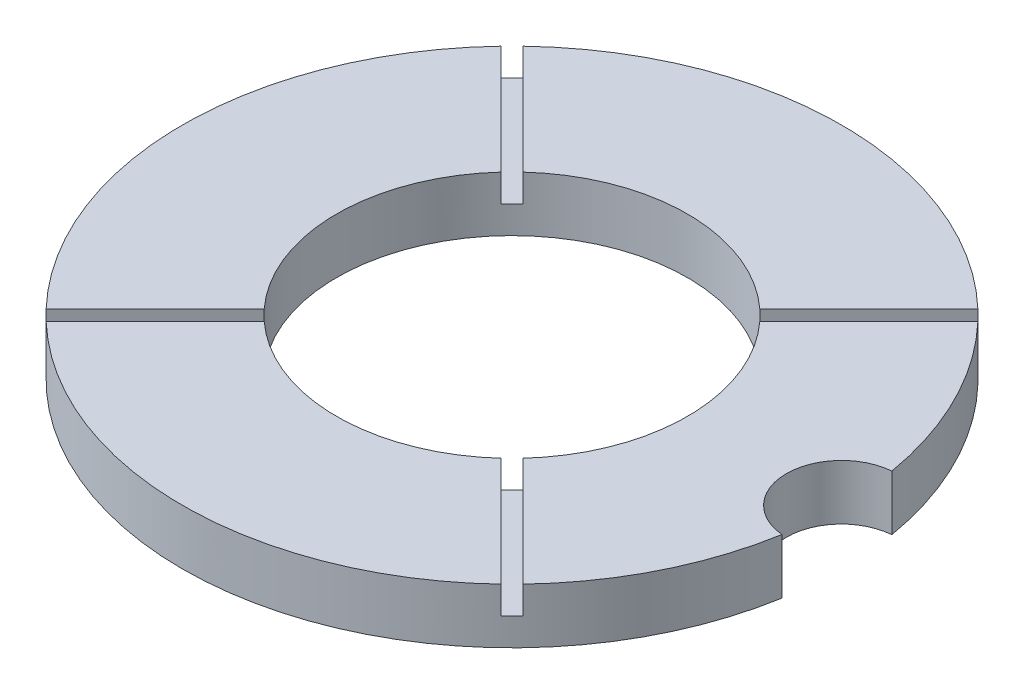
ISO-10303-21;
HEADER;
FILE_DESCRIPTION(('STEP AP214'),'2;1');
FILE_NAME('part.step','',(''),(''),'','','');
FILE_SCHEMA(('AUTOMOTIVE_DESIGN { 1 0 10303 214 1 1 1 1 }'));
ENDSEC;
DATA;
#1=APPLICATION_CONTEXT('core data for automotive mechanical design processes');
#2=APPLICATION_PROTOCOL_DEFINITION('international standard','automotive_design',2000,#1);
#3=PRODUCT_CONTEXT('',#1,'mechanical');
#4=PRODUCT('Part','Part','',(#3));
#5=PRODUCT_RELATED_PRODUCT_CATEGORY('part','',(#4));
#6=PRODUCT_DEFINITION_FORMATION('','',#4);
#7=PRODUCT_DEFINITION_CONTEXT('part definition',#1,'design');
#8=PRODUCT_DEFINITION('design','',#6,#7);
#9=PRODUCT_DEFINITION_SHAPE('','',#8);
#10=(LENGTH_UNIT() NAMED_UNIT(*) SI_UNIT(.MILLI.,.METRE.));
#11=(NAMED_UNIT(*) PLANE_ANGLE_UNIT() SI_UNIT($,.RADIAN.));
#12=(NAMED_UNIT(*) SI_UNIT($,.STERADIAN.) SOLID_ANGLE_UNIT());
#13=UNCERTAINTY_MEASURE_WITH_UNIT(LENGTH_MEASURE(1.E-05),#10,'distance_accuracy_value','');
#14=(GEOMETRIC_REPRESENTATION_CONTEXT(3) GLOBAL_UNCERTAINTY_ASSIGNED_CONTEXT((#13)) GLOBAL_UNIT_ASSIGNED_CONTEXT((#10,
#11,#12)) REPRESENTATION_CONTEXT('',''));
#15=CARTESIAN_POINT('',(0.,0.,0.));
#16=DIRECTION('',(0.,0.,1.));
#17=DIRECTION('',(1.,0.,0.));
#18=AXIS2_PLACEMENT_3D('',#15,#16,#17);
#19=CARTESIAN_POINT('',(0.,12.7,0.));
#20=DIRECTION('',(0.,1.,0.));
#21=DIRECTION('',(0.,0.,1.));
#22=AXIS2_PLACEMENT_3D('',#19,#20,#21);
#23=PLANE('',#22);
#24=DIRECTION('',(0.707106781186546,0.,-0.707106781186555));
#25=VECTOR('',#24,1.);
#26=CARTESIAN_POINT('',(-25.7014930184937,12.7,28.1800437079155));
#27=LINE('',#26,#25);
#28=CARTESIAN_POINT('',(-52.4303897259787,12.7,54.9089404154006));
#29=VERTEX_POINT('',#28);
#30=CARTESIAN_POINT('',(-27.3090139490453,12.7,29.787564638468));
#31=VERTEX_POINT('',#30);
#32=EDGE_CURVE('E272',#29,#31,#27,.T.);
#33=ORIENTED_EDGE('',*,*,#32,.F.);
#34=CARTESIAN_POINT('',(0.,12.7,0.));
#35=DIRECTION('',(0.,1.,0.));
#36=DIRECTION('',(0.,0.,1.));
#37=AXIS2_PLACEMENT_3D('',#34,#35,#36);
#38=CIRCLE('',#37,75.9206);
#39=CARTESIAN_POINT('',(52.4303897259896,12.7,54.908940415392));
#40=VERTEX_POINT('',#39);
#41=EDGE_CURVE('E210',#29,#40,#38,.T.);
#42=ORIENTED_EDGE('',*,*,#41,.T.);
#43=DIRECTION('',(0.707106781186555,0.,0.707106781186546));
#44=VECTOR('',#43,1.);
#45=CARTESIAN_POINT('',(25.7014930185073,12.7,28.1800437079099));
#46=LINE('',#45,#44);
#47=CARTESIAN_POINT('',(27.3090139490553,12.7,29.7875646384579));
#48=VERTEX_POINT('',#47);
#49=EDGE_CURVE('E357',#48,#40,#46,.T.);
#50=ORIENTED_EDGE('',*,*,#49,.F.);
#51=CARTESIAN_POINT('',(0.,12.7,0.));
#52=DIRECTION('',(0.,1.,0.));
#53=DIRECTION('',(0.,0.,1.));
#54=AXIS2_PLACEMENT_3D('',#51,#52,#53);
#55=CIRCLE('',#54,40.4114);
#56=EDGE_CURVE('E280',#31,#48,#55,.T.);
#57=ORIENTED_EDGE('',*,*,#56,.F.);
#58=EDGE_LOOP('',(#33,#42,#50,#57));
#59=FACE_BOUND('',#58,.T.);
#60=ADVANCED_FACE('F53',(#59),#23,.T.);
#61=DIRECTION('',(-0.707106781186555,0.,-0.707106781186546));
#62=VECTOR('',#61,1.);
#63=CARTESIAN_POINT('',(28.1800437079215,12.7,25.7014930184939));
#64=LINE('',#63,#62);
#65=CARTESIAN_POINT('',(54.9089404154035,12.7,52.4303897259765));
#66=VERTEX_POINT('',#65);
#67=CARTESIAN_POINT('',(29.7875646384708,12.7,27.3090139490432));
#68=VERTEX_POINT('',#67);
#69=EDGE_CURVE('E361',#66,#68,#64,.T.);
#70=ORIENTED_EDGE('',*,*,#69,.F.);
#71=CARTESIAN_POINT('',(74.8583718300435,12.7,12.6554996469904));
#72=VERTEX_POINT('',#71);
#73=EDGE_CURVE('E218',#66,#72,#38,.T.);
#74=ORIENTED_EDGE('',*,*,#73,.T.);
#75=CARTESIAN_POINT('',(75.9206,12.7,9.99200722162641E-13));
#76=DIRECTION('',(0.,1.,0.));
#77=DIRECTION('',(0.,0.,1.));
#78=AXIS2_PLACEMENT_3D('',#75,#76,#77);
#79=CIRCLE('',#78,12.7);
#80=CARTESIAN_POINT('',(74.8583718300444,12.7,-12.6554996469894));
#81=VERTEX_POINT('',#80);
#82=EDGE_CURVE('E295',#81,#72,#79,.T.);
#83=ORIENTED_EDGE('',*,*,#82,.F.);
#84=CARTESIAN_POINT('',(54.908940415395,12.7,-52.4303897259856));
#85=VERTEX_POINT('',#84);
#86=EDGE_CURVE('E216',#81,#85,#38,.T.);
#87=ORIENTED_EDGE('',*,*,#86,.T.);
#88=DIRECTION('',(0.707106781186546,0.,-0.707106781186555));
#89=VECTOR('',#88,1.);
#90=CARTESIAN_POINT('',(28.180043707915,12.7,-25.7014930185052));
#91=LINE('',#90,#89);
#92=CARTESIAN_POINT('',(29.7875646384609,12.7,-27.3090139490519));
#93=VERTEX_POINT('',#92);
#94=EDGE_CURVE('E370',#93,#85,#91,.T.);
#95=ORIENTED_EDGE('',*,*,#94,.F.);
#96=EDGE_CURVE('E230',#68,#93,#55,.T.);
#97=ORIENTED_EDGE('',*,*,#96,.F.);
#98=EDGE_LOOP('',(#70,#74,#83,#87,#95,#97));
#99=FACE_BOUND('',#98,.T.);
#100=ADVANCED_FACE('F390',(#99),#23,.T.);
#101=DIRECTION('',(-0.707106781186546,0.,0.707106781186555));
#102=VECTOR('',#101,1.);
#103=CARTESIAN_POINT('',(25.7014930185,12.7,-28.1800437079203));
#104=LINE('',#103,#102);
#105=CARTESIAN_POINT('',(52.4303897259789,12.7,-54.9089404153994));
#106=VERTEX_POINT('',#105);
#107=CARTESIAN_POINT('',(27.3090139490465,12.7,-29.7875646384658));
#108=VERTEX_POINT('',#107);
#109=EDGE_CURVE('E202',#106,#108,#104,.T.);
#110=ORIENTED_EDGE('',*,*,#109,.F.);
#111=CARTESIAN_POINT('',(-52.4303897259825,12.7,-54.9089404153958));
#112=VERTEX_POINT('',#111);
#113=EDGE_CURVE('E209',#106,#112,#38,.T.);
#114=ORIENTED_EDGE('',*,*,#113,.T.);
#115=DIRECTION('',(-0.707106781186555,0.,-0.707106781186547));
#116=VECTOR('',#115,1.);
#117=CARTESIAN_POINT('',(-25.7014930184991,12.7,-28.1800437079148));
#118=LINE('',#117,#116);
#119=CARTESIAN_POINT('',(-27.3090139490489,12.7,-29.7875646384628));
#120=VERTEX_POINT('',#119);
#121=EDGE_CURVE('E201',#120,#112,#118,.T.);
#122=ORIENTED_EDGE('',*,*,#121,.F.);
#123=EDGE_CURVE('E279',#108,#120,#55,.T.);
#124=ORIENTED_EDGE('',*,*,#123,.F.);
#125=EDGE_LOOP('',(#110,#114,#122,#124));
#126=FACE_BOUND('',#125,.T.);
#127=ADVANCED_FACE('F405',(#126),#23,.T.);
#128=CARTESIAN_POINT('',(0.,12.7,0.));
#129=DIRECTION('',(0.,-1.,0.));
#130=DIRECTION('',(0.,0.,-1.));
#131=AXIS2_PLACEMENT_3D('',#128,#129,#130);
#132=CYLINDRICAL_SURFACE('',#131,75.9206);
#133=ORIENTED_EDGE('',*,*,#41,.F.);
#134=DIRECTION('',(0.,-1.,0.));
#135=VECTOR('',#134,1.);
#136=CARTESIAN_POINT('',(-52.4303897259787,12.7,54.9089404154006));
#137=LINE('',#136,#135);
#138=CARTESIAN_POINT('',(-52.4303897259787,6.34999999999999,54.9089404154006));
#139=VERTEX_POINT('',#138);
#140=EDGE_CURVE('E299',#29,#139,#137,.T.);
#141=ORIENTED_EDGE('',*,*,#140,.T.);
#142=CARTESIAN_POINT('',(0.,6.34999999999999,0.));
#143=DIRECTION('',(0.,-1.,0.));
#144=DIRECTION('',(0.,0.,-1.));
#145=AXIS2_PLACEMENT_3D('',#142,#143,#144);
#146=CIRCLE('',#145,75.9206);
#147=CARTESIAN_POINT('',(-54.9089404153937,6.34999999999999,52.4303897259858));
#148=VERTEX_POINT('',#147);
#149=EDGE_CURVE('E308',#139,#148,#146,.T.);
#150=ORIENTED_EDGE('',*,*,#149,.T.);
#151=DIRECTION('',(0.,-1.,0.));
#152=VECTOR('',#151,1.);
#153=CARTESIAN_POINT('',(-54.9089404153937,12.7,52.4303897259858));
#154=LINE('',#153,#152);
#155=CARTESIAN_POINT('',(-54.9089404153937,12.7,52.4303897259858));
#156=VERTEX_POINT('',#155);
#157=EDGE_CURVE('E207',#148,#156,#154,.F.);
#158=ORIENTED_EDGE('',*,*,#157,.T.);
#159=CARTESIAN_POINT('',(-54.9089404153965,12.7,-52.4303897259818));
#160=VERTEX_POINT('',#159);
#161=EDGE_CURVE('E197',#160,#156,#38,.T.);
#162=ORIENTED_EDGE('',*,*,#161,.F.);
#163=DIRECTION('',(0.,-1.,0.));
#164=VECTOR('',#163,1.);
#165=CARTESIAN_POINT('',(-54.9089404153965,12.7,-52.4303897259818));
#166=LINE('',#165,#164);
#167=CARTESIAN_POINT('',(-54.9089404153965,6.34999999999999,-52.4303897259818));
#168=VERTEX_POINT('',#167);
#169=EDGE_CURVE('E178',#160,#168,#166,.T.);
#170=ORIENTED_EDGE('',*,*,#169,.T.);
#171=CARTESIAN_POINT('',(0.,6.34999999999999,0.));
#172=DIRECTION('',(0.,-1.,0.));
#173=DIRECTION('',(0.,0.,-1.));
#174=AXIS2_PLACEMENT_3D('',#171,#172,#173);
#175=CIRCLE('',#174,75.9206);
#176=CARTESIAN_POINT('',(-52.4303897259825,6.34999999999999,-54.9089404153958));
#177=VERTEX_POINT('',#176);
#178=EDGE_CURVE('E337',#168,#177,#175,.T.);
#179=ORIENTED_EDGE('',*,*,#178,.T.);
#180=DIRECTION('',(0.,-1.,0.));
#181=VECTOR('',#180,1.);
#182=CARTESIAN_POINT('',(-52.4303897259825,12.7,-54.9089404153958));
#183=LINE('',#182,#181);
#184=EDGE_CURVE('E190',#177,#112,#183,.F.);
#185=ORIENTED_EDGE('',*,*,#184,.T.);
#186=ORIENTED_EDGE('',*,*,#113,.F.);
#187=DIRECTION('',(0.,-1.,0.));
#188=VECTOR('',#187,1.);
#189=CARTESIAN_POINT('',(52.4303897259789,12.7,-54.9089404153993));
#190=LINE('',#189,#188);
#191=CARTESIAN_POINT('',(52.4303897259789,6.34999999999999,-54.9089404153993));
#192=VERTEX_POINT('',#191);
#193=EDGE_CURVE('E323',#106,#192,#190,.T.);
#194=ORIENTED_EDGE('',*,*,#193,.T.);
#195=CARTESIAN_POINT('',(0.,6.34999999999999,0.));
#196=DIRECTION('',(0.,-1.,0.));
#197=DIRECTION('',(0.,0.,-1.));
#198=AXIS2_PLACEMENT_3D('',#195,#196,#197);
#199=CIRCLE('',#198,75.9206);
#200=CARTESIAN_POINT('',(54.908940415395,6.34999999999999,-52.4303897259856));
#201=VERTEX_POINT('',#200);
#202=EDGE_CURVE('E189',#192,#201,#199,.T.);
#203=ORIENTED_EDGE('',*,*,#202,.T.);
#204=DIRECTION('',(0.,-1.,0.));
#205=VECTOR('',#204,1.);
#206=CARTESIAN_POINT('',(54.908940415395,12.7,-52.4303897259856));
#207=LINE('',#206,#205);
#208=EDGE_CURVE('E327',#201,#85,#207,.F.);
#209=ORIENTED_EDGE('',*,*,#208,.T.);
#210=ORIENTED_EDGE('',*,*,#86,.F.);
#211=DIRECTION('',(0.,1.,0.));
#212=VECTOR('',#211,1.);
#213=CARTESIAN_POINT('',(74.8583718300444,0.,-12.6554996469894));
#214=LINE('',#213,#212);
#215=CARTESIAN_POINT('',(74.8583718300444,0.,-12.6554996469894));
#216=VERTEX_POINT('',#215);
#217=EDGE_CURVE('E287',#216,#81,#214,.T.);
#218=ORIENTED_EDGE('',*,*,#217,.F.);
#219=CARTESIAN_POINT('',(0.,0.,0.));
#220=DIRECTION('',(0.,1.,0.));
#221=DIRECTION('',(0.,0.,1.));
#222=AXIS2_PLACEMENT_3D('',#219,#220,#221);
#223=CIRCLE('',#222,75.9206);
#224=CARTESIAN_POINT('',(74.8583718300435,0.,12.6554996469904));
#225=VERTEX_POINT('',#224);
#226=EDGE_CURVE('E226',#216,#225,#223,.T.);
#227=ORIENTED_EDGE('',*,*,#226,.T.);
#228=DIRECTION('',(0.,1.,0.));
#229=VECTOR('',#228,1.);
#230=CARTESIAN_POINT('',(74.8583718300435,0.,12.6554996469904));
#231=LINE('',#230,#229);
#232=EDGE_CURVE('E290',#225,#72,#231,.T.);
#233=ORIENTED_EDGE('',*,*,#232,.T.);
#234=ORIENTED_EDGE('',*,*,#73,.F.);
#235=DIRECTION('',(0.,-1.,0.));
#236=VECTOR('',#235,1.);
#237=CARTESIAN_POINT('',(54.9089404154035,12.7,52.4303897259765));
#238=LINE('',#237,#236);
#239=CARTESIAN_POINT('',(54.9089404154035,6.34999999999999,52.4303897259765));
#240=VERTEX_POINT('',#239);
#241=EDGE_CURVE('E311',#66,#240,#238,.T.);
#242=ORIENTED_EDGE('',*,*,#241,.T.);
#243=CARTESIAN_POINT('',(0.,6.34999999999999,0.));
#244=DIRECTION('',(0.,-1.,0.));
#245=DIRECTION('',(0.,0.,-1.));
#246=AXIS2_PLACEMENT_3D('',#243,#244,#245);
#247=CIRCLE('',#246,75.9206);
#248=CARTESIAN_POINT('',(52.4303897259896,6.34999999999999,54.908940415392));
#249=VERTEX_POINT('',#248);
#250=EDGE_CURVE('E319',#240,#249,#247,.T.);
#251=ORIENTED_EDGE('',*,*,#250,.T.);
#252=DIRECTION('',(0.,-1.,0.));
#253=VECTOR('',#252,1.);
#254=CARTESIAN_POINT('',(52.4303897259896,12.7,54.9089404153918));
#255=LINE('',#254,#253);
#256=EDGE_CURVE('E315',#249,#40,#255,.F.);
#257=ORIENTED_EDGE('',*,*,#256,.T.);
#258=EDGE_LOOP('',(#133,#141,#150,#158,#162,#170,#179,#185,#186,#194,#203,#209,#210,#218,#227,
#233,#234,#242,#251,#257));
#259=FACE_BOUND('',#258,.T.);
#260=ADVANCED_FACE('F55',(#259),#132,.T.);
#261=DIRECTION('',(-0.707106781186546,0.,0.707106781186555));
#262=VECTOR('',#261,1.);
#263=CARTESIAN_POINT('',(-28.1800437079087,12.7,25.7014930185013));
#264=LINE('',#263,#262);
#265=CARTESIAN_POINT('',(-29.7875646384597,12.7,27.3090139490523));
#266=VERTEX_POINT('',#265);
#267=EDGE_CURVE('E266',#266,#156,#264,.T.);
#268=ORIENTED_EDGE('',*,*,#267,.F.);
#269=CARTESIAN_POINT('',(-29.787564638464,12.7,-27.3090139490485));
#270=VERTEX_POINT('',#269);
#271=EDGE_CURVE('E199',#270,#266,#55,.T.);
#272=ORIENTED_EDGE('',*,*,#271,.F.);
#273=DIRECTION('',(0.707106781186555,0.,0.707106781186546));
#274=VECTOR('',#273,1.);
#275=CARTESIAN_POINT('',(-28.1800437079152,12.7,-25.7014930184998));
#276=LINE('',#275,#274);
#277=EDGE_CURVE('E182',#160,#270,#276,.T.);
#278=ORIENTED_EDGE('',*,*,#277,.F.);
#279=ORIENTED_EDGE('',*,*,#161,.T.);
#280=EDGE_LOOP('',(#268,#272,#278,#279));
#281=FACE_BOUND('',#280,.T.);
#282=ADVANCED_FACE('F196',(#281),#23,.T.);
#283=CARTESIAN_POINT('',(0.,0.,0.));
#284=DIRECTION('',(0.,1.,0.));
#285=DIRECTION('',(0.,0.,1.));
#286=AXIS2_PLACEMENT_3D('',#283,#284,#285);
#287=PLANE('',#286);
#288=CARTESIAN_POINT('',(0.,0.,0.));
#289=DIRECTION('',(0.,1.,0.));
#290=DIRECTION('',(0.,0.,1.));
#291=AXIS2_PLACEMENT_3D('',#288,#289,#290);
#292=CIRCLE('',#291,40.4114);
#293=CARTESIAN_POINT('',(0.,0.,40.4114000000002));
#294=VERTEX_POINT('',#293);
#295=EDGE_CURVE('E224',#294,#294,#292,.T.);
#296=ORIENTED_EDGE('',*,*,#295,.T.);
#297=EDGE_LOOP('',(#296));
#298=FACE_BOUND('',#297,.T.);
#299=ORIENTED_EDGE('',*,*,#226,.F.);
#300=CARTESIAN_POINT('',(75.9206,0.,9.99200722162641E-13));
#301=DIRECTION('',(0.,1.,0.));
#302=DIRECTION('',(0.,0.,1.));
#303=AXIS2_PLACEMENT_3D('',#300,#301,#302);
#304=CIRCLE('',#303,12.7);
#305=EDGE_CURVE('E291',#216,#225,#304,.T.);
#306=ORIENTED_EDGE('',*,*,#305,.T.);
#307=EDGE_LOOP('',(#299,#306));
#308=FACE_BOUND('',#307,.T.);
#309=ADVANCED_FACE('F396',(#298,#308),#287,.F.);
#310=CARTESIAN_POINT('',(0.,12.7,0.));
#311=DIRECTION('',(0.,-1.,0.));
#312=DIRECTION('',(0.,0.,-1.));
#313=AXIS2_PLACEMENT_3D('',#310,#311,#312);
#314=CYLINDRICAL_SURFACE('',#313,40.4114);
#315=DIRECTION('',(0.,-1.,0.));
#316=VECTOR('',#315,1.);
#317=CARTESIAN_POINT('',(-27.3090139490453,12.7,29.787564638468));
#318=LINE('',#317,#316);
#319=CARTESIAN_POINT('',(-27.3090139490453,6.34999999999999,29.787564638468));
#320=VERTEX_POINT('',#319);
#321=EDGE_CURVE('E13',#31,#320,#318,.T.);
#322=ORIENTED_EDGE('',*,*,#321,.F.);
#323=ORIENTED_EDGE('',*,*,#56,.T.);
#324=DIRECTION('',(0.,-1.,0.));
#325=VECTOR('',#324,1.);
#326=CARTESIAN_POINT('',(27.3090139490553,12.7,29.7875646384579));
#327=LINE('',#326,#325);
#328=CARTESIAN_POINT('',(27.3090139490553,6.34999999999999,29.7875646384579));
#329=VERTEX_POINT('',#328);
#330=EDGE_CURVE('E252',#329,#48,#327,.F.);
#331=ORIENTED_EDGE('',*,*,#330,.F.);
#332=CARTESIAN_POINT('',(0.,6.34999999999999,0.));
#333=DIRECTION('',(0.,-1.,0.));
#334=DIRECTION('',(0.,0.,-1.));
#335=AXIS2_PLACEMENT_3D('',#332,#333,#334);
#336=CIRCLE('',#335,40.4114);
#337=CARTESIAN_POINT('',(29.7875646384708,6.34999999999999,27.3090139490432));
#338=VERTEX_POINT('',#337);
#339=EDGE_CURVE('E249',#338,#329,#336,.T.);
#340=ORIENTED_EDGE('',*,*,#339,.F.);
#341=DIRECTION('',(0.,-1.,0.));
#342=VECTOR('',#341,1.);
#343=CARTESIAN_POINT('',(29.7875646384708,12.7,27.3090139490432));
#344=LINE('',#343,#342);
#345=EDGE_CURVE('E255',#68,#338,#344,.T.);
#346=ORIENTED_EDGE('',*,*,#345,.F.);
#347=ORIENTED_EDGE('',*,*,#96,.T.);
#348=DIRECTION('',(0.,-1.,0.));
#349=VECTOR('',#348,1.);
#350=CARTESIAN_POINT('',(29.7875646384609,12.7,-27.3090139490519));
#351=LINE('',#350,#349);
#352=CARTESIAN_POINT('',(29.7875646384609,6.34999999999999,-27.3090139490519));
#353=VERTEX_POINT('',#352);
#354=EDGE_CURVE('E242',#353,#93,#351,.F.);
#355=ORIENTED_EDGE('',*,*,#354,.F.);
#356=CARTESIAN_POINT('',(0.,6.34999999999999,0.));
#357=DIRECTION('',(0.,-1.,0.));
#358=DIRECTION('',(0.,0.,-1.));
#359=AXIS2_PLACEMENT_3D('',#356,#357,#358);
#360=CIRCLE('',#359,40.4114);
#361=CARTESIAN_POINT('',(27.3090139490465,6.34999999999999,-29.7875646384658));
#362=VERTEX_POINT('',#361);
#363=EDGE_CURVE('E239',#362,#353,#360,.T.);
#364=ORIENTED_EDGE('',*,*,#363,.F.);
#365=DIRECTION('',(0.,-1.,0.));
#366=VECTOR('',#365,1.);
#367=CARTESIAN_POINT('',(27.3090139490465,12.7,-29.7875646384658));
#368=LINE('',#367,#366);
#369=EDGE_CURVE('E245',#108,#362,#368,.T.);
#370=ORIENTED_EDGE('',*,*,#369,.F.);
#371=ORIENTED_EDGE('',*,*,#123,.T.);
#372=DIRECTION('',(0.,-1.,0.));
#373=VECTOR('',#372,1.);
#374=CARTESIAN_POINT('',(-27.3090139490489,12.7,-29.7875646384627));
#375=LINE('',#374,#373);
#376=CARTESIAN_POINT('',(-27.3090139490489,6.34999999999999,-29.7875646384628));
#377=VERTEX_POINT('',#376);
#378=EDGE_CURVE('E233',#377,#120,#375,.F.);
#379=ORIENTED_EDGE('',*,*,#378,.F.);
#380=CARTESIAN_POINT('',(0.,6.34999999999999,0.));
#381=DIRECTION('',(0.,-1.,0.));
#382=DIRECTION('',(0.,0.,-1.));
#383=AXIS2_PLACEMENT_3D('',#380,#381,#382);
#384=CIRCLE('',#383,40.4114);
#385=CARTESIAN_POINT('',(-29.787564638464,6.34999999999999,-27.3090139490485));
#386=VERTEX_POINT('',#385);
#387=EDGE_CURVE('E223',#386,#377,#384,.T.);
#388=ORIENTED_EDGE('',*,*,#387,.F.);
#389=DIRECTION('',(0.,-1.,0.));
#390=VECTOR('',#389,1.);
#391=CARTESIAN_POINT('',(-29.787564638464,12.7,-27.3090139490485));
#392=LINE('',#391,#390);
#393=EDGE_CURVE('E236',#270,#386,#392,.T.);
#394=ORIENTED_EDGE('',*,*,#393,.F.);
#395=ORIENTED_EDGE('',*,*,#271,.T.);
#396=DIRECTION('',(0.,-1.,0.));
#397=VECTOR('',#396,1.);
#398=CARTESIAN_POINT('',(-29.7875646384597,12.7,27.3090139490523));
#399=LINE('',#398,#397);
#400=CARTESIAN_POINT('',(-29.7875646384597,6.34999999999999,27.3090139490523));
#401=VERTEX_POINT('',#400);
#402=EDGE_CURVE('E62',#401,#266,#399,.F.);
#403=ORIENTED_EDGE('',*,*,#402,.F.);
#404=CARTESIAN_POINT('',(0.,6.34999999999999,0.));
#405=DIRECTION('',(0.,-1.,0.));
#406=DIRECTION('',(0.,0.,-1.));
#407=AXIS2_PLACEMENT_3D('',#404,#405,#406);
#408=CIRCLE('',#407,40.4114);
#409=EDGE_CURVE('E258',#320,#401,#408,.T.);
#410=ORIENTED_EDGE('',*,*,#409,.F.);
#411=EDGE_LOOP('',(#322,#323,#331,#340,#346,#347,#355,#364,#370,#371,#379,#388,#394,#395,#403,#410));
#412=FACE_BOUND('',#411,.T.);
#413=ORIENTED_EDGE('',*,*,#295,.F.);
#414=EDGE_LOOP('',(#413));
#415=FACE_BOUND('',#414,.T.);
#416=ADVANCED_FACE('F275',(#412,#415),#314,.F.);
#417=CARTESIAN_POINT('',(75.9206,0.,9.99200722162641E-13));
#418=DIRECTION('',(0.,1.,0.));
#419=DIRECTION('',(0.,0.,1.));
#420=AXIS2_PLACEMENT_3D('',#417,#418,#419);
#421=CYLINDRICAL_SURFACE('',#420,12.7);
#422=ORIENTED_EDGE('',*,*,#82,.T.);
#423=ORIENTED_EDGE('',*,*,#232,.F.);
#424=ORIENTED_EDGE('',*,*,#305,.F.);
#425=ORIENTED_EDGE('',*,*,#217,.T.);
#426=EDGE_LOOP('',(#422,#423,#424,#425));
#427=FACE_BOUND('',#426,.T.);
#428=ADVANCED_FACE('F393',(#427),#421,.F.);
#429=CARTESIAN_POINT('',(-28.1800437079152,6.34999999999999,-25.7014930184998));
#430=DIRECTION('',(-0.707106781186546,0.,0.707106781186554));
#431=DIRECTION('',(0.707106781186555,0.,0.707106781186547));
#432=AXIS2_PLACEMENT_3D('',#429,#430,#431);
#433=PLANE('',#432);
#434=ORIENTED_EDGE('',*,*,#277,.T.);
#435=ORIENTED_EDGE('',*,*,#393,.T.);
#436=DIRECTION('',(0.707106781186555,0.,0.707106781186546));
#437=VECTOR('',#436,1.);
#438=CARTESIAN_POINT('',(-28.1800437079152,6.34999999999999,-25.7014930184998));
#439=LINE('',#438,#437);
#440=EDGE_CURVE('E184',#168,#386,#439,.T.);
#441=ORIENTED_EDGE('',*,*,#440,.F.);
#442=ORIENTED_EDGE('',*,*,#169,.F.);
#443=EDGE_LOOP('',(#434,#435,#441,#442));
#444=FACE_BOUND('',#443,.T.);
#445=ADVANCED_FACE('F180',(#444),#433,.F.);
#446=CARTESIAN_POINT('',(-25.7014930184991,6.34999999999999,-28.1800437079148));
#447=DIRECTION('',(0.707106781186546,0.,-0.707106781186555));
#448=DIRECTION('',(-0.707106781186555,0.,-0.707106781186546));
#449=AXIS2_PLACEMENT_3D('',#446,#447,#448);
#450=PLANE('',#449);
#451=DIRECTION('',(-0.707106781186555,0.,-0.707106781186547));
#452=VECTOR('',#451,1.);
#453=CARTESIAN_POINT('',(-25.7014930184991,6.34999999999999,-28.1800437079148));
#454=LINE('',#453,#452);
#455=EDGE_CURVE('E340',#377,#177,#454,.T.);
#456=ORIENTED_EDGE('',*,*,#455,.F.);
#457=ORIENTED_EDGE('',*,*,#378,.T.);
#458=ORIENTED_EDGE('',*,*,#121,.T.);
#459=ORIENTED_EDGE('',*,*,#184,.F.);
#460=EDGE_LOOP('',(#456,#457,#458,#459));
#461=FACE_BOUND('',#460,.T.);
#462=ADVANCED_FACE('F418',(#461),#450,.F.);
#463=CARTESIAN_POINT('',(0.,6.34999999999999,0.));
#464=DIRECTION('',(0.,-1.,0.));
#465=DIRECTION('',(0.,0.,-1.));
#466=AXIS2_PLACEMENT_3D('',#463,#464,#465);
#467=PLANE('',#466);
#468=ORIENTED_EDGE('',*,*,#440,.T.);
#469=ORIENTED_EDGE('',*,*,#387,.T.);
#470=ORIENTED_EDGE('',*,*,#455,.T.);
#471=ORIENTED_EDGE('',*,*,#178,.F.);
#472=EDGE_LOOP('',(#468,#469,#470,#471));
#473=FACE_BOUND('',#472,.T.);
#474=ADVANCED_FACE('F421',(#473),#467,.F.);
#475=CARTESIAN_POINT('',(25.7014930185,6.34999999999999,-28.1800437079203));
#476=DIRECTION('',(-0.707106781186554,0.,-0.707106781186546));
#477=DIRECTION('',(-0.707106781186547,0.,0.707106781186555));
#478=AXIS2_PLACEMENT_3D('',#475,#476,#477);
#479=PLANE('',#478);
#480=ORIENTED_EDGE('',*,*,#109,.T.);
#481=ORIENTED_EDGE('',*,*,#369,.T.);
#482=DIRECTION('',(-0.707106781186546,0.,0.707106781186555));
#483=VECTOR('',#482,1.);
#484=CARTESIAN_POINT('',(25.7014930185,6.34999999999999,-28.1800437079203));
#485=LINE('',#484,#483);
#486=EDGE_CURVE('E367',#192,#362,#485,.T.);
#487=ORIENTED_EDGE('',*,*,#486,.F.);
#488=ORIENTED_EDGE('',*,*,#193,.F.);
#489=EDGE_LOOP('',(#480,#481,#487,#488));
#490=FACE_BOUND('',#489,.T.);
#491=ADVANCED_FACE('F425',(#490),#479,.F.);
#492=CARTESIAN_POINT('',(28.180043707915,6.34999999999999,-25.7014930185052));
#493=DIRECTION('',(0.707106781186554,0.,0.707106781186546));
#494=DIRECTION('',(0.707106781186547,0.,-0.707106781186555));
#495=AXIS2_PLACEMENT_3D('',#492,#493,#494);
#496=PLANE('',#495);
#497=DIRECTION('',(0.707106781186546,0.,-0.707106781186555));
#498=VECTOR('',#497,1.);
#499=CARTESIAN_POINT('',(28.180043707915,6.34999999999999,-25.7014930185052));
#500=LINE('',#499,#498);
#501=EDGE_CURVE('E364',#353,#201,#500,.T.);
#502=ORIENTED_EDGE('',*,*,#501,.F.);
#503=ORIENTED_EDGE('',*,*,#354,.T.);
#504=ORIENTED_EDGE('',*,*,#94,.T.);
#505=ORIENTED_EDGE('',*,*,#208,.F.);
#506=EDGE_LOOP('',(#502,#503,#504,#505));
#507=FACE_BOUND('',#506,.T.);
#508=ADVANCED_FACE('F381',(#507),#496,.F.);
#509=CARTESIAN_POINT('',(0.,6.34999999999999,0.));
#510=DIRECTION('',(0.,-1.,0.));
#511=DIRECTION('',(0.,0.,-1.));
#512=AXIS2_PLACEMENT_3D('',#509,#510,#511);
#513=PLANE('',#512);
#514=ORIENTED_EDGE('',*,*,#486,.T.);
#515=ORIENTED_EDGE('',*,*,#363,.T.);
#516=ORIENTED_EDGE('',*,*,#501,.T.);
#517=ORIENTED_EDGE('',*,*,#202,.F.);
#518=EDGE_LOOP('',(#514,#515,#516,#517));
#519=FACE_BOUND('',#518,.T.);
#520=ADVANCED_FACE('F446',(#519),#513,.F.);
#521=CARTESIAN_POINT('',(28.1800437079215,6.34999999999999,25.7014930184939));
#522=DIRECTION('',(0.707106781186546,0.,-0.707106781186555));
#523=DIRECTION('',(-0.707106781186555,0.,-0.707106781186546));
#524=AXIS2_PLACEMENT_3D('',#521,#522,#523);
#525=PLANE('',#524);
#526=ORIENTED_EDGE('',*,*,#69,.T.);
#527=ORIENTED_EDGE('',*,*,#345,.T.);
#528=DIRECTION('',(-0.707106781186555,0.,-0.707106781186546));
#529=VECTOR('',#528,1.);
#530=CARTESIAN_POINT('',(28.1800437079215,6.34999999999999,25.7014930184939));
#531=LINE('',#530,#529);
#532=EDGE_CURVE('E76',#240,#338,#531,.T.);
#533=ORIENTED_EDGE('',*,*,#532,.F.);
#534=ORIENTED_EDGE('',*,*,#241,.F.);
#535=EDGE_LOOP('',(#526,#527,#533,#534));
#536=FACE_BOUND('',#535,.T.);
#537=ADVANCED_FACE('F442',(#536),#525,.F.);
#538=CARTESIAN_POINT('',(25.7014930185073,6.34999999999999,28.1800437079099));
#539=DIRECTION('',(-0.707106781186546,0.,0.707106781186555));
#540=DIRECTION('',(0.707106781186555,0.,0.707106781186546));
#541=AXIS2_PLACEMENT_3D('',#538,#539,#540);
#542=PLANE('',#541);
#543=DIRECTION('',(0.707106781186555,0.,0.707106781186546));
#544=VECTOR('',#543,1.);
#545=CARTESIAN_POINT('',(25.7014930185073,6.34999999999999,28.1800437079099));
#546=LINE('',#545,#544);
#547=EDGE_CURVE('E353',#329,#249,#546,.T.);
#548=ORIENTED_EDGE('',*,*,#547,.F.);
#549=ORIENTED_EDGE('',*,*,#330,.T.);
#550=ORIENTED_EDGE('',*,*,#49,.T.);
#551=ORIENTED_EDGE('',*,*,#256,.F.);
#552=EDGE_LOOP('',(#548,#549,#550,#551));
#553=FACE_BOUND('',#552,.T.);
#554=ADVANCED_FACE('F439',(#553),#542,.F.);
#555=CARTESIAN_POINT('',(0.,6.34999999999999,0.));
#556=DIRECTION('',(0.,-1.,0.));
#557=DIRECTION('',(0.,0.,-1.));
#558=AXIS2_PLACEMENT_3D('',#555,#556,#557);
#559=PLANE('',#558);
#560=ORIENTED_EDGE('',*,*,#532,.T.);
#561=ORIENTED_EDGE('',*,*,#339,.T.);
#562=ORIENTED_EDGE('',*,*,#547,.T.);
#563=ORIENTED_EDGE('',*,*,#250,.F.);
#564=EDGE_LOOP('',(#560,#561,#562,#563));
#565=FACE_BOUND('',#564,.T.);
#566=ADVANCED_FACE('F435',(#565),#559,.F.);
#567=CARTESIAN_POINT('',(-25.7014930184937,6.34999999999999,28.1800437079155));
#568=DIRECTION('',(0.707106781186555,0.,0.707106781186546));
#569=DIRECTION('',(0.707106781186546,0.,-0.707106781186555));
#570=AXIS2_PLACEMENT_3D('',#567,#568,#569);
#571=PLANE('',#570);
#572=ORIENTED_EDGE('',*,*,#32,.T.);
#573=ORIENTED_EDGE('',*,*,#321,.T.);
#574=DIRECTION('',(0.707106781186546,0.,-0.707106781186555));
#575=VECTOR('',#574,1.);
#576=CARTESIAN_POINT('',(-25.7014930184937,6.34999999999999,28.1800437079155));
#577=LINE('',#576,#575);
#578=EDGE_CURVE('E69',#139,#320,#577,.T.);
#579=ORIENTED_EDGE('',*,*,#578,.F.);
#580=ORIENTED_EDGE('',*,*,#140,.F.);
#581=EDGE_LOOP('',(#572,#573,#579,#580));
#582=FACE_BOUND('',#581,.T.);
#583=ADVANCED_FACE('F432',(#582),#571,.F.);
#584=CARTESIAN_POINT('',(-28.1800437079087,6.34999999999999,25.7014930185013));
#585=DIRECTION('',(-0.707106781186555,0.,-0.707106781186546));
#586=DIRECTION('',(-0.707106781186546,0.,0.707106781186555));
#587=AXIS2_PLACEMENT_3D('',#584,#585,#586);
#588=PLANE('',#587);
#589=DIRECTION('',(-0.707106781186546,0.,0.707106781186555));
#590=VECTOR('',#589,1.);
#591=CARTESIAN_POINT('',(-28.1800437079087,6.34999999999999,25.7014930185013));
#592=LINE('',#591,#590);
#593=EDGE_CURVE('E268',#401,#148,#592,.T.);
#594=ORIENTED_EDGE('',*,*,#593,.F.);
#595=ORIENTED_EDGE('',*,*,#402,.T.);
#596=ORIENTED_EDGE('',*,*,#267,.T.);
#597=ORIENTED_EDGE('',*,*,#157,.F.);
#598=EDGE_LOOP('',(#594,#595,#596,#597));
#599=FACE_BOUND('',#598,.T.);
#600=ADVANCED_FACE('F265',(#599),#588,.F.);
#601=CARTESIAN_POINT('',(0.,6.34999999999999,0.));
#602=DIRECTION('',(0.,-1.,0.));
#603=DIRECTION('',(0.,0.,-1.));
#604=AXIS2_PLACEMENT_3D('',#601,#602,#603);
#605=PLANE('',#604);
#606=ORIENTED_EDGE('',*,*,#578,.T.);
#607=ORIENTED_EDGE('',*,*,#409,.T.);
#608=ORIENTED_EDGE('',*,*,#593,.T.);
#609=ORIENTED_EDGE('',*,*,#149,.F.);
#610=EDGE_LOOP('',(#606,#607,#608,#609));
#611=FACE_BOUND('',#610,.T.);
#612=ADVANCED_FACE('F427',(#611),#605,.F.);
#613=CLOSED_SHELL('',(#60,#100,#127,#260,#282,#309,#416,#428,#445,#462,#474,#491,#508,#520,#537,
#554,#566,#583,#600,#612));
#614=MANIFOLD_SOLID_BREP('B2',#613);
#615=ADVANCED_BREP_SHAPE_REPRESENTATION('',(#18,#614),#14);
#616=SHAPE_DEFINITION_REPRESENTATION(#9,#615);
ENDSEC;
END-ISO-10303-21;
